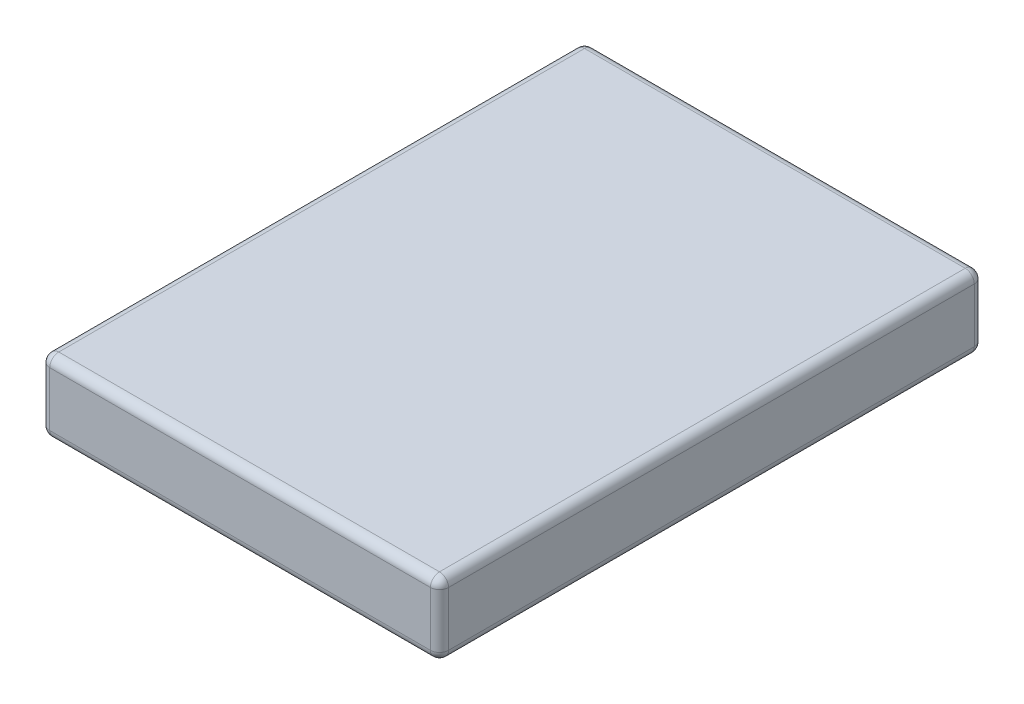
ISO-10303-21;
HEADER;
FILE_DESCRIPTION(('STEP AP214'),'2;1');
FILE_NAME('part.step','',(''),(''),'','','');
FILE_SCHEMA(('AUTOMOTIVE_DESIGN { 1 0 10303 214 1 1 1 1 }'));
ENDSEC;
DATA;
#1=APPLICATION_CONTEXT('core data for automotive mechanical design processes');
#2=APPLICATION_PROTOCOL_DEFINITION('international standard','automotive_design',2000,#1);
#3=PRODUCT_CONTEXT('',#1,'mechanical');
#4=PRODUCT('Part','Part','',(#3));
#5=PRODUCT_RELATED_PRODUCT_CATEGORY('part','',(#4));
#6=PRODUCT_DEFINITION_FORMATION('','',#4);
#7=PRODUCT_DEFINITION_CONTEXT('part definition',#1,'design');
#8=PRODUCT_DEFINITION('design','',#6,#7);
#9=PRODUCT_DEFINITION_SHAPE('','',#8);
#10=(LENGTH_UNIT() NAMED_UNIT(*) SI_UNIT(.MILLI.,.METRE.));
#11=(NAMED_UNIT(*) PLANE_ANGLE_UNIT() SI_UNIT($,.RADIAN.));
#12=(NAMED_UNIT(*) SI_UNIT($,.STERADIAN.) SOLID_ANGLE_UNIT());
#13=UNCERTAINTY_MEASURE_WITH_UNIT(LENGTH_MEASURE(1.E-05),#10,'distance_accuracy_value','');
#14=(GEOMETRIC_REPRESENTATION_CONTEXT(3) GLOBAL_UNCERTAINTY_ASSIGNED_CONTEXT((#13)) GLOBAL_UNIT_ASSIGNED_CONTEXT((#10,
#11,#12)) REPRESENTATION_CONTEXT('',''));
#15=CARTESIAN_POINT('',(0.,0.,0.));
#16=DIRECTION('',(0.,0.,1.));
#17=DIRECTION('',(1.,0.,0.));
#18=AXIS2_PLACEMENT_3D('',#15,#16,#17);
#19=CARTESIAN_POINT('',(-5.5,2.,7.5));
#20=DIRECTION('',(1.,0.,0.));
#21=DIRECTION('',(0.,0.,-1.));
#22=AXIS2_PLACEMENT_3D('',#19,#20,#21);
#23=PLANE('',#22);
#24=DIRECTION('',(0.,0.,1.));
#25=VECTOR('',#24,1.);
#26=CARTESIAN_POINT('',(-5.5,1.75,-7.5));
#27=LINE('',#26,#25);
#28=CARTESIAN_POINT('',(-5.5,1.75,7.25));
#29=VERTEX_POINT('',#28);
#30=CARTESIAN_POINT('',(-5.5,1.75,-7.25));
#31=VERTEX_POINT('',#30);
#32=EDGE_CURVE('E137',#29,#31,#27,.F.);
#33=ORIENTED_EDGE('',*,*,#32,.T.);
#34=DIRECTION('',(0.,-1.,0.));
#35=VECTOR('',#34,1.);
#36=CARTESIAN_POINT('',(-5.5,2.,-7.25));
#37=LINE('',#36,#35);
#38=CARTESIAN_POINT('',(-5.5,0.25,-7.25));
#39=VERTEX_POINT('',#38);
#40=EDGE_CURVE('E133',#31,#39,#37,.T.);
#41=ORIENTED_EDGE('',*,*,#40,.T.);
#42=DIRECTION('',(0.,0.,1.));
#43=VECTOR('',#42,1.);
#44=CARTESIAN_POINT('',(-5.5,0.25,7.5));
#45=LINE('',#44,#43);
#46=CARTESIAN_POINT('',(-5.5,0.25,7.25));
#47=VERTEX_POINT('',#46);
#48=EDGE_CURVE('E128',#39,#47,#45,.T.);
#49=ORIENTED_EDGE('',*,*,#48,.T.);
#50=DIRECTION('',(0.,-1.,0.));
#51=VECTOR('',#50,1.);
#52=CARTESIAN_POINT('',(-5.5,2.,7.25));
#53=LINE('',#52,#51);
#54=EDGE_CURVE('E130',#47,#29,#53,.F.);
#55=ORIENTED_EDGE('',*,*,#54,.T.);
#56=EDGE_LOOP('',(#33,#41,#49,#55));
#57=FACE_BOUND('',#56,.T.);
#58=ADVANCED_FACE('F39',(#57),#23,.F.);
#59=CARTESIAN_POINT('',(5.5,2.,7.5));
#60=DIRECTION('',(0.,0.,-1.));
#61=DIRECTION('',(-1.,0.,0.));
#62=AXIS2_PLACEMENT_3D('',#59,#60,#61);
#63=PLANE('',#62);
#64=DIRECTION('',(1.,0.,0.));
#65=VECTOR('',#64,1.);
#66=CARTESIAN_POINT('',(-5.5,1.75,7.5));
#67=LINE('',#66,#65);
#68=CARTESIAN_POINT('',(5.25,1.75,7.5));
#69=VERTEX_POINT('',#68);
#70=CARTESIAN_POINT('',(-5.25,1.75,7.5));
#71=VERTEX_POINT('',#70);
#72=EDGE_CURVE('E48',#69,#71,#67,.F.);
#73=ORIENTED_EDGE('',*,*,#72,.T.);
#74=DIRECTION('',(0.,-1.,0.));
#75=VECTOR('',#74,1.);
#76=CARTESIAN_POINT('',(-5.25,2.,7.5));
#77=LINE('',#76,#75);
#78=CARTESIAN_POINT('',(-5.25,0.25,7.5));
#79=VERTEX_POINT('',#78);
#80=EDGE_CURVE('E11',#71,#79,#77,.T.);
#81=ORIENTED_EDGE('',*,*,#80,.T.);
#82=DIRECTION('',(1.,0.,0.));
#83=VECTOR('',#82,1.);
#84=CARTESIAN_POINT('',(5.5,0.25,7.5));
#85=LINE('',#84,#83);
#86=CARTESIAN_POINT('',(5.25,0.25,7.5));
#87=VERTEX_POINT('',#86);
#88=EDGE_CURVE('E225',#79,#87,#85,.T.);
#89=ORIENTED_EDGE('',*,*,#88,.T.);
#90=DIRECTION('',(0.,-1.,0.));
#91=VECTOR('',#90,1.);
#92=CARTESIAN_POINT('',(5.25,2.,7.5));
#93=LINE('',#92,#91);
#94=EDGE_CURVE('E59',#87,#69,#93,.F.);
#95=ORIENTED_EDGE('',*,*,#94,.T.);
#96=EDGE_LOOP('',(#73,#81,#89,#95));
#97=FACE_BOUND('',#96,.T.);
#98=ADVANCED_FACE('F324',(#97),#63,.F.);
#99=CARTESIAN_POINT('',(5.5,2.,7.5));
#100=DIRECTION('',(-1.,0.,0.));
#101=DIRECTION('',(0.,0.,1.));
#102=AXIS2_PLACEMENT_3D('',#99,#100,#101);
#103=PLANE('',#102);
#104=DIRECTION('',(0.,0.,-1.));
#105=VECTOR('',#104,1.);
#106=CARTESIAN_POINT('',(5.5,0.25,7.5));
#107=LINE('',#106,#105);
#108=CARTESIAN_POINT('',(5.5,0.25,7.25));
#109=VERTEX_POINT('',#108);
#110=CARTESIAN_POINT('',(5.5,0.25,-7.25));
#111=VERTEX_POINT('',#110);
#112=EDGE_CURVE('E285',#109,#111,#107,.T.);
#113=ORIENTED_EDGE('',*,*,#112,.T.);
#114=DIRECTION('',(0.,-1.,0.));
#115=VECTOR('',#114,1.);
#116=CARTESIAN_POINT('',(5.5,2.,-7.25));
#117=LINE('',#116,#115);
#118=CARTESIAN_POINT('',(5.5,1.75,-7.25));
#119=VERTEX_POINT('',#118);
#120=EDGE_CURVE('E287',#111,#119,#117,.F.);
#121=ORIENTED_EDGE('',*,*,#120,.T.);
#122=DIRECTION('',(0.,0.,-1.));
#123=VECTOR('',#122,1.);
#124=CARTESIAN_POINT('',(5.5,1.75,7.5));
#125=LINE('',#124,#123);
#126=CARTESIAN_POINT('',(5.5,1.75,7.25));
#127=VERTEX_POINT('',#126);
#128=EDGE_CURVE('E216',#119,#127,#125,.F.);
#129=ORIENTED_EDGE('',*,*,#128,.T.);
#130=DIRECTION('',(0.,-1.,0.));
#131=VECTOR('',#130,1.);
#132=CARTESIAN_POINT('',(5.5,2.,7.25));
#133=LINE('',#132,#131);
#134=EDGE_CURVE('E282',#127,#109,#133,.T.);
#135=ORIENTED_EDGE('',*,*,#134,.T.);
#136=EDGE_LOOP('',(#113,#121,#129,#135));
#137=FACE_BOUND('',#136,.T.);
#138=ADVANCED_FACE('F328',(#137),#103,.F.);
#139=CARTESIAN_POINT('',(5.5,2.,-7.5));
#140=DIRECTION('',(0.,0.,1.));
#141=DIRECTION('',(1.,0.,0.));
#142=AXIS2_PLACEMENT_3D('',#139,#140,#141);
#143=PLANE('',#142);
#144=DIRECTION('',(-1.,0.,0.));
#145=VECTOR('',#144,1.);
#146=CARTESIAN_POINT('',(5.5,0.25,-7.5));
#147=LINE('',#146,#145);
#148=CARTESIAN_POINT('',(5.25,0.25,-7.5));
#149=VERTEX_POINT('',#148);
#150=CARTESIAN_POINT('',(-5.25,0.25,-7.5));
#151=VERTEX_POINT('',#150);
#152=EDGE_CURVE('E266',#149,#151,#147,.T.);
#153=ORIENTED_EDGE('',*,*,#152,.T.);
#154=DIRECTION('',(0.,-1.,0.));
#155=VECTOR('',#154,1.);
#156=CARTESIAN_POINT('',(-5.25,2.,-7.5));
#157=LINE('',#156,#155);
#158=CARTESIAN_POINT('',(-5.25,1.75,-7.5));
#159=VERTEX_POINT('',#158);
#160=EDGE_CURVE('E263',#151,#159,#157,.F.);
#161=ORIENTED_EDGE('',*,*,#160,.T.);
#162=DIRECTION('',(-1.,0.,0.));
#163=VECTOR('',#162,1.);
#164=CARTESIAN_POINT('',(5.5,1.75,-7.5));
#165=LINE('',#164,#163);
#166=CARTESIAN_POINT('',(5.25,1.75,-7.5));
#167=VERTEX_POINT('',#166);
#168=EDGE_CURVE('E255',#159,#167,#165,.F.);
#169=ORIENTED_EDGE('',*,*,#168,.T.);
#170=DIRECTION('',(0.,-1.,0.));
#171=VECTOR('',#170,1.);
#172=CARTESIAN_POINT('',(5.25,2.,-7.5));
#173=LINE('',#172,#171);
#174=EDGE_CURVE('E260',#167,#149,#173,.T.);
#175=ORIENTED_EDGE('',*,*,#174,.T.);
#176=EDGE_LOOP('',(#153,#161,#169,#175));
#177=FACE_BOUND('',#176,.T.);
#178=ADVANCED_FACE('F264',(#177),#143,.F.);
#179=CARTESIAN_POINT('',(0.,2.,0.));
#180=DIRECTION('',(0.,1.,0.));
#181=DIRECTION('',(0.,0.,1.));
#182=AXIS2_PLACEMENT_3D('',#179,#180,#181);
#183=PLANE('',#182);
#184=DIRECTION('',(0.,0.,-1.));
#185=VECTOR('',#184,1.);
#186=CARTESIAN_POINT('',(5.25,2.,-7.5));
#187=LINE('',#186,#185);
#188=CARTESIAN_POINT('',(5.25,2.,7.25));
#189=VERTEX_POINT('',#188);
#190=CARTESIAN_POINT('',(5.25,2.,-7.25));
#191=VERTEX_POINT('',#190);
#192=EDGE_CURVE('E218',#189,#191,#187,.T.);
#193=ORIENTED_EDGE('',*,*,#192,.T.);
#194=DIRECTION('',(-1.,0.,0.));
#195=VECTOR('',#194,1.);
#196=CARTESIAN_POINT('',(-5.5,2.,-7.25));
#197=LINE('',#196,#195);
#198=CARTESIAN_POINT('',(-5.25,2.,-7.25));
#199=VERTEX_POINT('',#198);
#200=EDGE_CURVE('E222',#191,#199,#197,.T.);
#201=ORIENTED_EDGE('',*,*,#200,.T.);
#202=DIRECTION('',(0.,0.,1.));
#203=VECTOR('',#202,1.);
#204=CARTESIAN_POINT('',(-5.25,2.,7.5));
#205=LINE('',#204,#203);
#206=CARTESIAN_POINT('',(-5.25,2.,7.25));
#207=VERTEX_POINT('',#206);
#208=EDGE_CURVE('E223',#199,#207,#205,.T.);
#209=ORIENTED_EDGE('',*,*,#208,.T.);
#210=DIRECTION('',(1.,0.,0.));
#211=VECTOR('',#210,1.);
#212=CARTESIAN_POINT('',(5.5,2.,7.25));
#213=LINE('',#212,#211);
#214=EDGE_CURVE('E227',#207,#189,#213,.T.);
#215=ORIENTED_EDGE('',*,*,#214,.T.);
#216=EDGE_LOOP('',(#193,#201,#209,#215));
#217=FACE_BOUND('',#216,.T.);
#218=ADVANCED_FACE('F289',(#217),#183,.T.);
#219=CARTESIAN_POINT('',(0.,0.,0.));
#220=DIRECTION('',(0.,1.,0.));
#221=DIRECTION('',(0.,0.,1.));
#222=AXIS2_PLACEMENT_3D('',#219,#220,#221);
#223=PLANE('',#222);
#224=DIRECTION('',(0.,0.,1.));
#225=VECTOR('',#224,1.);
#226=CARTESIAN_POINT('',(-5.25,0.,0.));
#227=LINE('',#226,#225);
#228=CARTESIAN_POINT('',(-5.25,0.,7.25));
#229=VERTEX_POINT('',#228);
#230=CARTESIAN_POINT('',(-5.25,0.,-7.25));
#231=VERTEX_POINT('',#230);
#232=EDGE_CURVE('E158',#229,#231,#227,.F.);
#233=ORIENTED_EDGE('',*,*,#232,.T.);
#234=DIRECTION('',(-1.,0.,0.));
#235=VECTOR('',#234,1.);
#236=CARTESIAN_POINT('',(0.,0.,-7.25));
#237=LINE('',#236,#235);
#238=CARTESIAN_POINT('',(5.25,0.,-7.25));
#239=VERTEX_POINT('',#238);
#240=EDGE_CURVE('E279',#231,#239,#237,.F.);
#241=ORIENTED_EDGE('',*,*,#240,.T.);
#242=DIRECTION('',(0.,0.,-1.));
#243=VECTOR('',#242,1.);
#244=CARTESIAN_POINT('',(5.25,0.,0.));
#245=LINE('',#244,#243);
#246=CARTESIAN_POINT('',(5.25,0.,7.25));
#247=VERTEX_POINT('',#246);
#248=EDGE_CURVE('E272',#239,#247,#245,.F.);
#249=ORIENTED_EDGE('',*,*,#248,.T.);
#250=DIRECTION('',(1.,0.,0.));
#251=VECTOR('',#250,1.);
#252=CARTESIAN_POINT('',(0.,0.,7.25));
#253=LINE('',#252,#251);
#254=EDGE_CURVE('E270',#247,#229,#253,.F.);
#255=ORIENTED_EDGE('',*,*,#254,.T.);
#256=EDGE_LOOP('',(#233,#241,#249,#255));
#257=FACE_BOUND('',#256,.T.);
#258=ADVANCED_FACE('F336',(#257),#223,.F.);
#259=CARTESIAN_POINT('',(5.25,2.,7.25));
#260=DIRECTION('',(0.,-1.,0.));
#261=DIRECTION('',(0.,0.,-1.));
#262=AXIS2_PLACEMENT_3D('',#259,#260,#261);
#263=CYLINDRICAL_SURFACE('',#262,0.25);
#264=CARTESIAN_POINT('',(5.25,1.75,7.25));
#265=DIRECTION('',(0.,1.,0.));
#266=DIRECTION('',(0.,0.,1.));
#267=AXIS2_PLACEMENT_3D('',#264,#265,#266);
#268=CIRCLE('',#267,0.25);
#269=EDGE_CURVE('E43',#69,#127,#268,.T.);
#270=ORIENTED_EDGE('',*,*,#269,.F.);
#271=ORIENTED_EDGE('',*,*,#94,.F.);
#272=CARTESIAN_POINT('',(5.25,0.25,7.25));
#273=DIRECTION('',(0.,-1.,0.));
#274=DIRECTION('',(0.,0.,-1.));
#275=AXIS2_PLACEMENT_3D('',#272,#273,#274);
#276=CIRCLE('',#275,0.25);
#277=EDGE_CURVE('E198',#109,#87,#276,.T.);
#278=ORIENTED_EDGE('',*,*,#277,.F.);
#279=ORIENTED_EDGE('',*,*,#134,.F.);
#280=EDGE_LOOP('',(#270,#271,#278,#279));
#281=FACE_BOUND('',#280,.T.);
#282=ADVANCED_FACE('F41',(#281),#263,.T.);
#283=CARTESIAN_POINT('',(5.25,1.75,7.25));
#284=DIRECTION('',(1.,0.,0.));
#285=DIRECTION('',(0.,0.,-1.));
#286=AXIS2_PLACEMENT_3D('',#283,#284,#285);
#287=SPHERICAL_SURFACE('',#286,0.25);
#288=CARTESIAN_POINT('',(5.25,1.75,7.25));
#289=DIRECTION('',(1.,0.,0.));
#290=DIRECTION('',(0.,0.,-1.));
#291=AXIS2_PLACEMENT_3D('',#288,#289,#290);
#292=CIRCLE('',#291,0.25);
#293=EDGE_CURVE('E193',#69,#189,#292,.F.);
#294=ORIENTED_EDGE('',*,*,#293,.F.);
#295=ORIENTED_EDGE('',*,*,#269,.T.);
#296=CARTESIAN_POINT('',(5.25,1.75,7.25));
#297=DIRECTION('',(0.,0.,1.));
#298=DIRECTION('',(0.,-1.,0.));
#299=AXIS2_PLACEMENT_3D('',#296,#297,#298);
#300=CIRCLE('',#299,0.25);
#301=EDGE_CURVE('E196',#189,#127,#300,.F.);
#302=ORIENTED_EDGE('',*,*,#301,.F.);
#303=EDGE_LOOP('',(#294,#295,#302));
#304=FACE_BOUND('',#303,.T.);
#305=ADVANCED_FACE('F208',(#304),#287,.T.);
#306=CARTESIAN_POINT('',(5.25,0.25,7.25));
#307=DIRECTION('',(0.,0.,1.));
#308=DIRECTION('',(1.,0.,0.));
#309=AXIS2_PLACEMENT_3D('',#306,#307,#308);
#310=SPHERICAL_SURFACE('',#309,0.25);
#311=CARTESIAN_POINT('',(5.25,0.25,7.25));
#312=DIRECTION('',(0.,0.,1.));
#313=DIRECTION('',(1.,0.,0.));
#314=AXIS2_PLACEMENT_3D('',#311,#312,#313);
#315=CIRCLE('',#314,0.25);
#316=EDGE_CURVE('E187',#109,#247,#315,.F.);
#317=ORIENTED_EDGE('',*,*,#316,.F.);
#318=ORIENTED_EDGE('',*,*,#277,.T.);
#319=CARTESIAN_POINT('',(5.25,0.25,7.25));
#320=DIRECTION('',(1.,0.,0.));
#321=DIRECTION('',(0.,0.,-1.));
#322=AXIS2_PLACEMENT_3D('',#319,#320,#321);
#323=CIRCLE('',#322,0.25);
#324=EDGE_CURVE('E190',#247,#87,#323,.F.);
#325=ORIENTED_EDGE('',*,*,#324,.F.);
#326=EDGE_LOOP('',(#317,#318,#325));
#327=FACE_BOUND('',#326,.T.);
#328=ADVANCED_FACE('F363',(#327),#310,.T.);
#329=CARTESIAN_POINT('',(5.25,1.75,0.));
#330=DIRECTION('',(0.,0.,1.));
#331=DIRECTION('',(1.,0.,0.));
#332=AXIS2_PLACEMENT_3D('',#329,#330,#331);
#333=CYLINDRICAL_SURFACE('',#332,0.25);
#334=ORIENTED_EDGE('',*,*,#301,.T.);
#335=ORIENTED_EDGE('',*,*,#128,.F.);
#336=CARTESIAN_POINT('',(5.25,1.75,-7.25));
#337=DIRECTION('',(0.,0.,-1.));
#338=DIRECTION('',(-1.,0.,0.));
#339=AXIS2_PLACEMENT_3D('',#336,#337,#338);
#340=CIRCLE('',#339,0.25);
#341=EDGE_CURVE('E182',#191,#119,#340,.T.);
#342=ORIENTED_EDGE('',*,*,#341,.F.);
#343=ORIENTED_EDGE('',*,*,#192,.F.);
#344=EDGE_LOOP('',(#334,#335,#342,#343));
#345=FACE_BOUND('',#344,.T.);
#346=ADVANCED_FACE('F214',(#345),#333,.T.);
#347=CARTESIAN_POINT('',(0.,1.75,7.25));
#348=DIRECTION('',(-1.,0.,0.));
#349=DIRECTION('',(0.,0.,1.));
#350=AXIS2_PLACEMENT_3D('',#347,#348,#349);
#351=CYLINDRICAL_SURFACE('',#350,0.25);
#352=ORIENTED_EDGE('',*,*,#293,.T.);
#353=ORIENTED_EDGE('',*,*,#214,.F.);
#354=CARTESIAN_POINT('',(-5.25,1.75,7.25));
#355=DIRECTION('',(-1.,0.,0.));
#356=DIRECTION('',(0.,0.,1.));
#357=AXIS2_PLACEMENT_3D('',#354,#355,#356);
#358=CIRCLE('',#357,0.25);
#359=EDGE_CURVE('E179',#71,#207,#358,.T.);
#360=ORIENTED_EDGE('',*,*,#359,.F.);
#361=ORIENTED_EDGE('',*,*,#72,.F.);
#362=EDGE_LOOP('',(#352,#353,#360,#361));
#363=FACE_BOUND('',#362,.T.);
#364=ADVANCED_FACE('F292',(#363),#351,.T.);
#365=CARTESIAN_POINT('',(-5.25,2.,7.25));
#366=DIRECTION('',(0.,-1.,0.));
#367=DIRECTION('',(0.,0.,-1.));
#368=AXIS2_PLACEMENT_3D('',#365,#366,#367);
#369=CYLINDRICAL_SURFACE('',#368,0.25);
#370=CARTESIAN_POINT('',(-5.25,0.25,7.25));
#371=DIRECTION('',(0.,-1.,0.));
#372=DIRECTION('',(0.,0.,-1.));
#373=AXIS2_PLACEMENT_3D('',#370,#371,#372);
#374=CIRCLE('',#373,0.25);
#375=EDGE_CURVE('E143',#79,#47,#374,.T.);
#376=ORIENTED_EDGE('',*,*,#375,.F.);
#377=ORIENTED_EDGE('',*,*,#80,.F.);
#378=CARTESIAN_POINT('',(-5.25,1.75,7.25));
#379=DIRECTION('',(0.,1.,0.));
#380=DIRECTION('',(0.,0.,1.));
#381=AXIS2_PLACEMENT_3D('',#378,#379,#380);
#382=CIRCLE('',#381,0.25);
#383=EDGE_CURVE('E146',#29,#71,#382,.T.);
#384=ORIENTED_EDGE('',*,*,#383,.F.);
#385=ORIENTED_EDGE('',*,*,#54,.F.);
#386=EDGE_LOOP('',(#376,#377,#384,#385));
#387=FACE_BOUND('',#386,.T.);
#388=ADVANCED_FACE('F142',(#387),#369,.T.);
#389=CARTESIAN_POINT('',(5.5,0.25,7.25));
#390=DIRECTION('',(1.,0.,0.));
#391=DIRECTION('',(0.,0.,-1.));
#392=AXIS2_PLACEMENT_3D('',#389,#390,#391);
#393=CYLINDRICAL_SURFACE('',#392,0.25);
#394=ORIENTED_EDGE('',*,*,#324,.T.);
#395=ORIENTED_EDGE('',*,*,#88,.F.);
#396=CARTESIAN_POINT('',(-5.25,0.25,7.25));
#397=DIRECTION('',(-1.,0.,0.));
#398=DIRECTION('',(0.,0.,1.));
#399=AXIS2_PLACEMENT_3D('',#396,#397,#398);
#400=CIRCLE('',#399,0.25);
#401=EDGE_CURVE('E155',#229,#79,#400,.T.);
#402=ORIENTED_EDGE('',*,*,#401,.F.);
#403=ORIENTED_EDGE('',*,*,#254,.F.);
#404=EDGE_LOOP('',(#394,#395,#402,#403));
#405=FACE_BOUND('',#404,.T.);
#406=ADVANCED_FACE('F391',(#405),#393,.T.);
#407=CARTESIAN_POINT('',(5.25,0.25,7.5));
#408=DIRECTION('',(0.,0.,-1.));
#409=DIRECTION('',(-1.,0.,0.));
#410=AXIS2_PLACEMENT_3D('',#407,#408,#409);
#411=CYLINDRICAL_SURFACE('',#410,0.25);
#412=ORIENTED_EDGE('',*,*,#316,.T.);
#413=ORIENTED_EDGE('',*,*,#248,.F.);
#414=CARTESIAN_POINT('',(5.25,0.25,-7.25));
#415=DIRECTION('',(0.,0.,-1.));
#416=DIRECTION('',(-1.,0.,0.));
#417=AXIS2_PLACEMENT_3D('',#414,#415,#416);
#418=CIRCLE('',#417,0.25);
#419=EDGE_CURVE('E174',#111,#239,#418,.T.);
#420=ORIENTED_EDGE('',*,*,#419,.F.);
#421=ORIENTED_EDGE('',*,*,#112,.F.);
#422=EDGE_LOOP('',(#412,#413,#420,#421));
#423=FACE_BOUND('',#422,.T.);
#424=ADVANCED_FACE('F399',(#423),#411,.T.);
#425=CARTESIAN_POINT('',(5.25,2.,-7.25));
#426=DIRECTION('',(0.,-1.,0.));
#427=DIRECTION('',(0.,0.,-1.));
#428=AXIS2_PLACEMENT_3D('',#425,#426,#427);
#429=CYLINDRICAL_SURFACE('',#428,0.25);
#430=CARTESIAN_POINT('',(5.25,1.75,-7.25));
#431=DIRECTION('',(0.,1.,0.));
#432=DIRECTION('',(0.,0.,1.));
#433=AXIS2_PLACEMENT_3D('',#430,#431,#432);
#434=CIRCLE('',#433,0.25);
#435=EDGE_CURVE('E184',#119,#167,#434,.T.);
#436=ORIENTED_EDGE('',*,*,#435,.F.);
#437=ORIENTED_EDGE('',*,*,#120,.F.);
#438=CARTESIAN_POINT('',(5.25,0.25,-7.25));
#439=DIRECTION('',(0.,-1.,0.));
#440=DIRECTION('',(0.,0.,-1.));
#441=AXIS2_PLACEMENT_3D('',#438,#439,#440);
#442=CIRCLE('',#441,0.25);
#443=EDGE_CURVE('E171',#149,#111,#442,.T.);
#444=ORIENTED_EDGE('',*,*,#443,.F.);
#445=ORIENTED_EDGE('',*,*,#174,.F.);
#446=EDGE_LOOP('',(#436,#437,#444,#445));
#447=FACE_BOUND('',#446,.T.);
#448=ADVANCED_FACE('F305',(#447),#429,.T.);
#449=CARTESIAN_POINT('',(5.25,1.75,-7.25));
#450=DIRECTION('',(1.,0.,0.));
#451=DIRECTION('',(0.,0.,-1.));
#452=AXIS2_PLACEMENT_3D('',#449,#450,#451);
#453=SPHERICAL_SURFACE('',#452,0.25);
#454=ORIENTED_EDGE('',*,*,#341,.T.);
#455=ORIENTED_EDGE('',*,*,#435,.T.);
#456=CARTESIAN_POINT('',(5.25,1.75,-7.25));
#457=DIRECTION('',(1.,0.,0.));
#458=DIRECTION('',(0.,0.,-1.));
#459=AXIS2_PLACEMENT_3D('',#456,#457,#458);
#460=CIRCLE('',#459,0.25);
#461=EDGE_CURVE('E163',#191,#167,#460,.F.);
#462=ORIENTED_EDGE('',*,*,#461,.F.);
#463=EDGE_LOOP('',(#454,#455,#462));
#464=FACE_BOUND('',#463,.T.);
#465=ADVANCED_FACE('F416',(#464),#453,.T.);
#466=CARTESIAN_POINT('',(-5.25,1.75,7.25));
#467=DIRECTION('',(0.,0.,1.));
#468=DIRECTION('',(1.,0.,0.));
#469=AXIS2_PLACEMENT_3D('',#466,#467,#468);
#470=SPHERICAL_SURFACE('',#469,0.25);
#471=ORIENTED_EDGE('',*,*,#383,.T.);
#472=ORIENTED_EDGE('',*,*,#359,.T.);
#473=CARTESIAN_POINT('',(-5.25,1.75,7.25));
#474=DIRECTION('',(0.,0.,1.));
#475=DIRECTION('',(1.,0.,0.));
#476=AXIS2_PLACEMENT_3D('',#473,#474,#475);
#477=CIRCLE('',#476,0.25);
#478=EDGE_CURVE('E159',#29,#207,#477,.F.);
#479=ORIENTED_EDGE('',*,*,#478,.F.);
#480=EDGE_LOOP('',(#471,#472,#479));
#481=FACE_BOUND('',#480,.T.);
#482=ADVANCED_FACE('F294',(#481),#470,.T.);
#483=CARTESIAN_POINT('',(-5.25,0.25,7.25));
#484=DIRECTION('',(0.,0.,1.));
#485=DIRECTION('',(1.,0.,0.));
#486=AXIS2_PLACEMENT_3D('',#483,#484,#485);
#487=SPHERICAL_SURFACE('',#486,0.25);
#488=ORIENTED_EDGE('',*,*,#401,.T.);
#489=ORIENTED_EDGE('',*,*,#375,.T.);
#490=CARTESIAN_POINT('',(-5.25,0.25,7.25));
#491=DIRECTION('',(0.,0.,1.));
#492=DIRECTION('',(1.,0.,0.));
#493=AXIS2_PLACEMENT_3D('',#490,#491,#492);
#494=CIRCLE('',#493,0.25);
#495=EDGE_CURVE('E152',#229,#47,#494,.F.);
#496=ORIENTED_EDGE('',*,*,#495,.F.);
#497=EDGE_LOOP('',(#488,#489,#496));
#498=FACE_BOUND('',#497,.T.);
#499=ADVANCED_FACE('F151',(#498),#487,.T.);
#500=CARTESIAN_POINT('',(5.25,0.25,-7.25));
#501=DIRECTION('',(1.,0.,0.));
#502=DIRECTION('',(0.,0.,-1.));
#503=AXIS2_PLACEMENT_3D('',#500,#501,#502);
#504=SPHERICAL_SURFACE('',#503,0.25);
#505=ORIENTED_EDGE('',*,*,#443,.T.);
#506=ORIENTED_EDGE('',*,*,#419,.T.);
#507=CARTESIAN_POINT('',(5.25,0.25,-7.25));
#508=DIRECTION('',(1.,0.,0.));
#509=DIRECTION('',(0.,0.,-1.));
#510=AXIS2_PLACEMENT_3D('',#507,#508,#509);
#511=CIRCLE('',#510,0.25);
#512=EDGE_CURVE('E160',#149,#239,#511,.F.);
#513=ORIENTED_EDGE('',*,*,#512,.F.);
#514=EDGE_LOOP('',(#505,#506,#513));
#515=FACE_BOUND('',#514,.T.);
#516=ADVANCED_FACE('F308',(#515),#504,.T.);
#517=CARTESIAN_POINT('',(0.,1.75,-7.25));
#518=DIRECTION('',(1.,0.,0.));
#519=DIRECTION('',(0.,0.,-1.));
#520=AXIS2_PLACEMENT_3D('',#517,#518,#519);
#521=CYLINDRICAL_SURFACE('',#520,0.25);
#522=ORIENTED_EDGE('',*,*,#461,.T.);
#523=ORIENTED_EDGE('',*,*,#168,.F.);
#524=CARTESIAN_POINT('',(-5.25,1.75,-7.25));
#525=DIRECTION('',(-1.,0.,0.));
#526=DIRECTION('',(0.,0.,1.));
#527=AXIS2_PLACEMENT_3D('',#524,#525,#526);
#528=CIRCLE('',#527,0.25);
#529=EDGE_CURVE('E165',#199,#159,#528,.T.);
#530=ORIENTED_EDGE('',*,*,#529,.F.);
#531=ORIENTED_EDGE('',*,*,#200,.F.);
#532=EDGE_LOOP('',(#522,#523,#530,#531));
#533=FACE_BOUND('',#532,.T.);
#534=ADVANCED_FACE('F257',(#533),#521,.T.);
#535=CARTESIAN_POINT('',(-5.25,1.75,0.));
#536=DIRECTION('',(0.,0.,-1.));
#537=DIRECTION('',(-1.,0.,0.));
#538=AXIS2_PLACEMENT_3D('',#535,#536,#537);
#539=CYLINDRICAL_SURFACE('',#538,0.25);
#540=ORIENTED_EDGE('',*,*,#478,.T.);
#541=ORIENTED_EDGE('',*,*,#208,.F.);
#542=CARTESIAN_POINT('',(-5.25,1.75,-7.25));
#543=DIRECTION('',(0.,0.,-1.));
#544=DIRECTION('',(0.,1.,0.));
#545=AXIS2_PLACEMENT_3D('',#542,#543,#544);
#546=CIRCLE('',#545,0.25);
#547=EDGE_CURVE('E244',#31,#199,#546,.T.);
#548=ORIENTED_EDGE('',*,*,#547,.F.);
#549=ORIENTED_EDGE('',*,*,#32,.F.);
#550=EDGE_LOOP('',(#540,#541,#548,#549));
#551=FACE_BOUND('',#550,.T.);
#552=ADVANCED_FACE('F297',(#551),#539,.T.);
#553=CARTESIAN_POINT('',(-5.25,0.25,7.5));
#554=DIRECTION('',(0.,0.,1.));
#555=DIRECTION('',(1.,0.,0.));
#556=AXIS2_PLACEMENT_3D('',#553,#554,#555);
#557=CYLINDRICAL_SURFACE('',#556,0.25);
#558=ORIENTED_EDGE('',*,*,#495,.T.);
#559=ORIENTED_EDGE('',*,*,#48,.F.);
#560=CARTESIAN_POINT('',(-5.25,0.25,-7.25));
#561=DIRECTION('',(0.,0.,-1.));
#562=DIRECTION('',(-1.,0.,0.));
#563=AXIS2_PLACEMENT_3D('',#560,#561,#562);
#564=CIRCLE('',#563,0.25);
#565=EDGE_CURVE('E241',#231,#39,#564,.T.);
#566=ORIENTED_EDGE('',*,*,#565,.F.);
#567=ORIENTED_EDGE('',*,*,#232,.F.);
#568=EDGE_LOOP('',(#558,#559,#566,#567));
#569=FACE_BOUND('',#568,.T.);
#570=ADVANCED_FACE('F157',(#569),#557,.T.);
#571=CARTESIAN_POINT('',(5.5,0.25,-7.25));
#572=DIRECTION('',(-1.,0.,0.));
#573=DIRECTION('',(0.,0.,1.));
#574=AXIS2_PLACEMENT_3D('',#571,#572,#573);
#575=CYLINDRICAL_SURFACE('',#574,0.25);
#576=ORIENTED_EDGE('',*,*,#512,.T.);
#577=ORIENTED_EDGE('',*,*,#240,.F.);
#578=CARTESIAN_POINT('',(-5.25,0.25,-7.25));
#579=DIRECTION('',(-1.,0.,0.));
#580=DIRECTION('',(0.,0.,1.));
#581=AXIS2_PLACEMENT_3D('',#578,#579,#580);
#582=CIRCLE('',#581,0.25);
#583=EDGE_CURVE('E238',#151,#231,#582,.T.);
#584=ORIENTED_EDGE('',*,*,#583,.F.);
#585=ORIENTED_EDGE('',*,*,#152,.F.);
#586=EDGE_LOOP('',(#576,#577,#584,#585));
#587=FACE_BOUND('',#586,.T.);
#588=ADVANCED_FACE('F312',(#587),#575,.T.);
#589=CARTESIAN_POINT('',(-5.25,1.75,-7.25));
#590=DIRECTION('',(0.,1.,0.));
#591=DIRECTION('',(0.,0.,1.));
#592=AXIS2_PLACEMENT_3D('',#589,#590,#591);
#593=SPHERICAL_SURFACE('',#592,0.25);
#594=ORIENTED_EDGE('',*,*,#547,.T.);
#595=ORIENTED_EDGE('',*,*,#529,.T.);
#596=CARTESIAN_POINT('',(-5.25,1.75,-7.25));
#597=DIRECTION('',(0.,1.,0.));
#598=DIRECTION('',(0.,0.,1.));
#599=AXIS2_PLACEMENT_3D('',#596,#597,#598);
#600=CIRCLE('',#599,0.25);
#601=EDGE_CURVE('E236',#31,#159,#600,.F.);
#602=ORIENTED_EDGE('',*,*,#601,.F.);
#603=EDGE_LOOP('',(#594,#595,#602));
#604=FACE_BOUND('',#603,.T.);
#605=ADVANCED_FACE('F250',(#604),#593,.T.);
#606=CARTESIAN_POINT('',(-5.25,0.25,-7.25));
#607=DIRECTION('',(0.,-1.,0.));
#608=DIRECTION('',(0.,0.,-1.));
#609=AXIS2_PLACEMENT_3D('',#606,#607,#608);
#610=SPHERICAL_SURFACE('',#609,0.25);
#611=ORIENTED_EDGE('',*,*,#583,.T.);
#612=ORIENTED_EDGE('',*,*,#565,.T.);
#613=CARTESIAN_POINT('',(-5.25,0.25,-7.25));
#614=DIRECTION('',(0.,-1.,0.));
#615=DIRECTION('',(0.,0.,-1.));
#616=AXIS2_PLACEMENT_3D('',#613,#614,#615);
#617=CIRCLE('',#616,0.25);
#618=EDGE_CURVE('E234',#151,#39,#617,.F.);
#619=ORIENTED_EDGE('',*,*,#618,.F.);
#620=EDGE_LOOP('',(#611,#612,#619));
#621=FACE_BOUND('',#620,.T.);
#622=ADVANCED_FACE('F314',(#621),#610,.T.);
#623=CARTESIAN_POINT('',(-5.25,2.,-7.25));
#624=DIRECTION('',(0.,-1.,0.));
#625=DIRECTION('',(0.,0.,-1.));
#626=AXIS2_PLACEMENT_3D('',#623,#624,#625);
#627=CYLINDRICAL_SURFACE('',#626,0.25);
#628=ORIENTED_EDGE('',*,*,#601,.T.);
#629=ORIENTED_EDGE('',*,*,#160,.F.);
#630=ORIENTED_EDGE('',*,*,#618,.T.);
#631=ORIENTED_EDGE('',*,*,#40,.F.);
#632=EDGE_LOOP('',(#628,#629,#630,#631));
#633=FACE_BOUND('',#632,.T.);
#634=ADVANCED_FACE('F315',(#633),#627,.T.);
#635=CLOSED_SHELL('',(#58,#98,#138,#178,#218,#258,#282,#305,#328,#346,#364,#388,#406,#424,#448,
#465,#482,#499,#516,#534,#552,#570,#588,#605,#622,#634));
#636=MANIFOLD_SOLID_BREP('B2',#635);
#637=ADVANCED_BREP_SHAPE_REPRESENTATION('',(#18,#636),#14);
#638=SHAPE_DEFINITION_REPRESENTATION(#9,#637);
ENDSEC;
END-ISO-10303-21;
